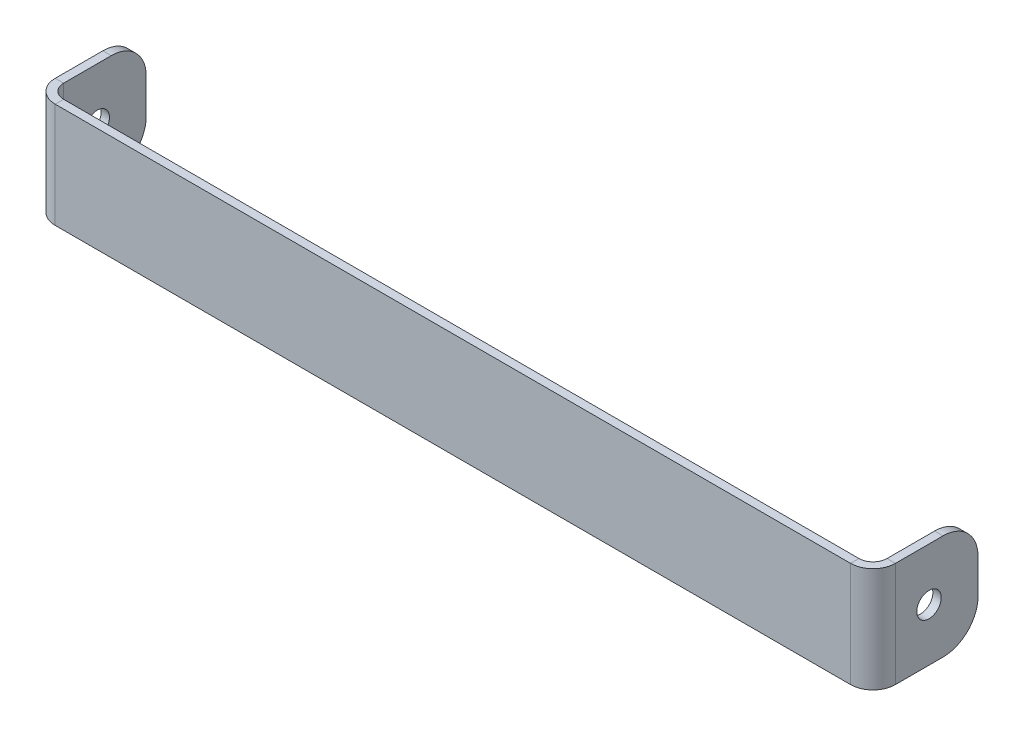
ISO-10303-21;
HEADER;
FILE_DESCRIPTION(('STEP AP214'),'2;1');
FILE_NAME('part.step','',(''),(''),'','','');
FILE_SCHEMA(('AUTOMOTIVE_DESIGN { 1 0 10303 214 1 1 1 1 }'));
ENDSEC;
DATA;
#1=APPLICATION_CONTEXT('core data for automotive mechanical design processes');
#2=APPLICATION_PROTOCOL_DEFINITION('international standard','automotive_design',2000,#1);
#3=PRODUCT_CONTEXT('',#1,'mechanical');
#4=PRODUCT('Part','Part','',(#3));
#5=PRODUCT_RELATED_PRODUCT_CATEGORY('part','',(#4));
#6=PRODUCT_DEFINITION_FORMATION('','',#4);
#7=PRODUCT_DEFINITION_CONTEXT('part definition',#1,'design');
#8=PRODUCT_DEFINITION('design','',#6,#7);
#9=PRODUCT_DEFINITION_SHAPE('','',#8);
#10=(LENGTH_UNIT() NAMED_UNIT(*) SI_UNIT(.MILLI.,.METRE.));
#11=(NAMED_UNIT(*) PLANE_ANGLE_UNIT() SI_UNIT($,.RADIAN.));
#12=(NAMED_UNIT(*) SI_UNIT($,.STERADIAN.) SOLID_ANGLE_UNIT());
#13=UNCERTAINTY_MEASURE_WITH_UNIT(LENGTH_MEASURE(1.E-05),#10,'distance_accuracy_value','');
#14=(GEOMETRIC_REPRESENTATION_CONTEXT(3) GLOBAL_UNCERTAINTY_ASSIGNED_CONTEXT((#13)) GLOBAL_UNIT_ASSIGNED_CONTEXT((#10,
#11,#12)) REPRESENTATION_CONTEXT('',''));
#15=CARTESIAN_POINT('',(0.,0.,0.));
#16=DIRECTION('',(0.,0.,1.));
#17=DIRECTION('',(1.,0.,0.));
#18=AXIS2_PLACEMENT_3D('',#15,#16,#17);
#19=CARTESIAN_POINT('',(120.,0.,3.66219024766989E-13));
#20=DIRECTION('',(-1.,0.,0.));
#21=DIRECTION('',(0.,0.,1.));
#22=AXIS2_PLACEMENT_3D('',#19,#20,#21);
#23=PLANE('',#22);
#24=DIRECTION('',(0.,1.,0.));
#25=VECTOR('',#24,1.);
#26=CARTESIAN_POINT('',(120.,0.,-15.));
#27=LINE('',#26,#25);
#28=CARTESIAN_POINT('',(120.,5.,-15.));
#29=VERTEX_POINT('',#28);
#30=CARTESIAN_POINT('',(120.,10.,-15.));
#31=VERTEX_POINT('',#30);
#32=EDGE_CURVE('E270',#29,#31,#27,.T.);
#33=ORIENTED_EDGE('',*,*,#32,.T.);
#34=CARTESIAN_POINT('',(120.,10.,-10.));
#35=DIRECTION('',(-1.,0.,0.));
#36=DIRECTION('',(0.,0.,1.));
#37=AXIS2_PLACEMENT_3D('',#34,#35,#36);
#38=CIRCLE('',#37,5.);
#39=CARTESIAN_POINT('',(120.,15.,-10.));
#40=VERTEX_POINT('',#39);
#41=EDGE_CURVE('E339',#31,#40,#38,.F.);
#42=ORIENTED_EDGE('',*,*,#41,.T.);
#43=DIRECTION('',(0.,0.,1.));
#44=VECTOR('',#43,1.);
#45=CARTESIAN_POINT('',(120.,15.,3.66219024766989E-13));
#46=LINE('',#45,#44);
#47=CARTESIAN_POINT('',(120.,15.,-3.19999999999999));
#48=VERTEX_POINT('',#47);
#49=EDGE_CURVE('E267',#40,#48,#46,.T.);
#50=ORIENTED_EDGE('',*,*,#49,.T.);
#51=DIRECTION('',(0.,-1.,0.));
#52=VECTOR('',#51,1.);
#53=CARTESIAN_POINT('',(120.,15.,-3.19999999999999));
#54=LINE('',#53,#52);
#55=CARTESIAN_POINT('',(120.,0.,-3.19999999999999));
#56=VERTEX_POINT('',#55);
#57=EDGE_CURVE('E284',#56,#48,#54,.F.);
#58=ORIENTED_EDGE('',*,*,#57,.F.);
#59=DIRECTION('',(0.,0.,-1.));
#60=VECTOR('',#59,1.);
#61=CARTESIAN_POINT('',(120.,0.,3.66219024766989E-13));
#62=LINE('',#61,#60);
#63=CARTESIAN_POINT('',(120.,0.,-10.));
#64=VERTEX_POINT('',#63);
#65=EDGE_CURVE('E273',#56,#64,#62,.T.);
#66=ORIENTED_EDGE('',*,*,#65,.T.);
#67=CARTESIAN_POINT('',(120.,5.,-10.));
#68=DIRECTION('',(-1.,0.,0.));
#69=DIRECTION('',(0.,0.,1.));
#70=AXIS2_PLACEMENT_3D('',#67,#68,#69);
#71=CIRCLE('',#70,5.);
#72=EDGE_CURVE('E337',#64,#29,#71,.F.);
#73=ORIENTED_EDGE('',*,*,#72,.T.);
#74=EDGE_LOOP('',(#33,#42,#50,#58,#66,#73));
#75=FACE_BOUND('',#74,.T.);
#76=CARTESIAN_POINT('',(120.,7.5,-8.));
#77=DIRECTION('',(1.,0.,0.));
#78=DIRECTION('',(0.,0.,-1.));
#79=AXIS2_PLACEMENT_3D('',#76,#77,#78);
#80=CIRCLE('',#79,1.75);
#81=CARTESIAN_POINT('',(120.,7.5,-9.75));
#82=VERTEX_POINT('',#81);
#83=EDGE_CURVE('E719',#82,#82,#80,.T.);
#84=ORIENTED_EDGE('',*,*,#83,.F.);
#85=EDGE_LOOP('',(#84));
#86=FACE_BOUND('',#85,.T.);
#87=ADVANCED_FACE('F90',(#75,#86),#23,.F.);
#88=CARTESIAN_POINT('',(0.,0.,-1.2));
#89=DIRECTION('',(0.,0.,-1.));
#90=DIRECTION('',(-1.,0.,0.));
#91=AXIS2_PLACEMENT_3D('',#88,#89,#90);
#92=PLANE('',#91);
#93=DIRECTION('',(1.,0.,0.));
#94=VECTOR('',#93,1.);
#95=CARTESIAN_POINT('',(0.,0.,-1.2));
#96=LINE('',#95,#94);
#97=CARTESIAN_POINT('',(3.19999999999999,0.,-1.2));
#98=VERTEX_POINT('',#97);
#99=CARTESIAN_POINT('',(116.8,0.,-1.2));
#100=VERTEX_POINT('',#99);
#101=EDGE_CURVE('E316',#98,#100,#96,.T.);
#102=ORIENTED_EDGE('',*,*,#101,.F.);
#103=DIRECTION('',(0.,1.,0.));
#104=VECTOR('',#103,1.);
#105=CARTESIAN_POINT('',(3.19999999999999,15.,-1.2));
#106=LINE('',#105,#104);
#107=CARTESIAN_POINT('',(3.19999999999999,15.,-1.2));
#108=VERTEX_POINT('',#107);
#109=EDGE_CURVE('E257',#108,#98,#106,.F.);
#110=ORIENTED_EDGE('',*,*,#109,.F.);
#111=DIRECTION('',(-1.,0.,0.));
#112=VECTOR('',#111,1.);
#113=CARTESIAN_POINT('',(0.,15.,-1.2));
#114=LINE('',#113,#112);
#115=CARTESIAN_POINT('',(116.8,15.,-1.2));
#116=VERTEX_POINT('',#115);
#117=EDGE_CURVE('E318',#116,#108,#114,.T.);
#118=ORIENTED_EDGE('',*,*,#117,.F.);
#119=DIRECTION('',(0.,-1.,0.));
#120=VECTOR('',#119,1.);
#121=CARTESIAN_POINT('',(116.8,0.,-1.2));
#122=LINE('',#121,#120);
#123=EDGE_CURVE('E306',#100,#116,#122,.F.);
#124=ORIENTED_EDGE('',*,*,#123,.F.);
#125=EDGE_LOOP('',(#102,#110,#118,#124));
#126=FACE_BOUND('',#125,.T.);
#127=ADVANCED_FACE('F381',(#126),#92,.T.);
#128=CARTESIAN_POINT('',(0.,0.,0.));
#129=DIRECTION('',(0.,0.,-1.));
#130=DIRECTION('',(-1.,0.,0.));
#131=AXIS2_PLACEMENT_3D('',#128,#129,#130);
#132=PLANE('',#131);
#133=DIRECTION('',(0.,1.,0.));
#134=VECTOR('',#133,1.);
#135=CARTESIAN_POINT('',(3.19999999999999,15.,0.));
#136=LINE('',#135,#134);
#137=CARTESIAN_POINT('',(3.19999999999999,15.,0.));
#138=VERTEX_POINT('',#137);
#139=CARTESIAN_POINT('',(3.19999999999999,0.,0.));
#140=VERTEX_POINT('',#139);
#141=EDGE_CURVE('E213',#138,#140,#136,.F.);
#142=ORIENTED_EDGE('',*,*,#141,.T.);
#143=DIRECTION('',(1.,0.,0.));
#144=VECTOR('',#143,1.);
#145=CARTESIAN_POINT('',(0.,0.,0.));
#146=LINE('',#145,#144);
#147=CARTESIAN_POINT('',(116.8,0.,0.));
#148=VERTEX_POINT('',#147);
#149=EDGE_CURVE('E314',#140,#148,#146,.T.);
#150=ORIENTED_EDGE('',*,*,#149,.T.);
#151=DIRECTION('',(0.,-1.,0.));
#152=VECTOR('',#151,1.);
#153=CARTESIAN_POINT('',(116.8,0.,0.));
#154=LINE('',#153,#152);
#155=CARTESIAN_POINT('',(116.8,15.,0.));
#156=VERTEX_POINT('',#155);
#157=EDGE_CURVE('E294',#148,#156,#154,.F.);
#158=ORIENTED_EDGE('',*,*,#157,.T.);
#159=DIRECTION('',(-1.,0.,0.));
#160=VECTOR('',#159,1.);
#161=CARTESIAN_POINT('',(0.,15.,0.));
#162=LINE('',#161,#160);
#163=EDGE_CURVE('E319',#156,#138,#162,.T.);
#164=ORIENTED_EDGE('',*,*,#163,.T.);
#165=EDGE_LOOP('',(#142,#150,#158,#164));
#166=FACE_BOUND('',#165,.T.);
#167=ADVANCED_FACE('F428',(#166),#132,.F.);
#168=CARTESIAN_POINT('',(0.,15.,-1.2));
#169=DIRECTION('',(0.,1.,0.));
#170=DIRECTION('',(0.,0.,1.));
#171=AXIS2_PLACEMENT_3D('',#168,#169,#170);
#172=PLANE('',#171);
#173=ORIENTED_EDGE('',*,*,#117,.T.);
#174=DIRECTION('',(0.,0.,1.));
#175=VECTOR('',#174,1.);
#176=CARTESIAN_POINT('',(3.19999999999999,15.,-1.2));
#177=LINE('',#176,#175);
#178=EDGE_CURVE('E253',#108,#138,#177,.T.);
#179=ORIENTED_EDGE('',*,*,#178,.T.);
#180=ORIENTED_EDGE('',*,*,#163,.F.);
#181=DIRECTION('',(0.,0.,1.));
#182=VECTOR('',#181,1.);
#183=CARTESIAN_POINT('',(116.8,15.,-1.2));
#184=LINE('',#183,#182);
#185=EDGE_CURVE('E311',#116,#156,#184,.T.);
#186=ORIENTED_EDGE('',*,*,#185,.F.);
#187=EDGE_LOOP('',(#173,#179,#180,#186));
#188=FACE_BOUND('',#187,.T.);
#189=ADVANCED_FACE('F430',(#188),#172,.T.);
#190=CARTESIAN_POINT('',(0.,0.,-1.2));
#191=DIRECTION('',(0.,-1.,0.));
#192=DIRECTION('',(0.,0.,-1.));
#193=AXIS2_PLACEMENT_3D('',#190,#191,#192);
#194=PLANE('',#193);
#195=DIRECTION('',(0.,0.,1.));
#196=VECTOR('',#195,1.);
#197=CARTESIAN_POINT('',(3.19999999999999,0.,-1.2));
#198=LINE('',#197,#196);
#199=EDGE_CURVE('E261',#98,#140,#198,.T.);
#200=ORIENTED_EDGE('',*,*,#199,.F.);
#201=ORIENTED_EDGE('',*,*,#101,.T.);
#202=DIRECTION('',(0.,0.,1.));
#203=VECTOR('',#202,1.);
#204=CARTESIAN_POINT('',(116.8,0.,-1.2));
#205=LINE('',#204,#203);
#206=EDGE_CURVE('E300',#100,#148,#205,.T.);
#207=ORIENTED_EDGE('',*,*,#206,.T.);
#208=ORIENTED_EDGE('',*,*,#149,.F.);
#209=EDGE_LOOP('',(#200,#201,#207,#208));
#210=FACE_BOUND('',#209,.T.);
#211=ADVANCED_FACE('F378',(#210),#194,.T.);
#212=CARTESIAN_POINT('',(116.8,15.,-3.2));
#213=DIRECTION('',(0.,1.,0.));
#214=DIRECTION('',(0.,0.,1.));
#215=AXIS2_PLACEMENT_3D('',#212,#213,#214);
#216=PLANE('',#215);
#217=DIRECTION('',(-1.,0.,0.));
#218=VECTOR('',#217,1.);
#219=CARTESIAN_POINT('',(120.,15.,-3.19999999999999));
#220=LINE('',#219,#218);
#221=CARTESIAN_POINT('',(118.8,15.,-3.19999999999999));
#222=VERTEX_POINT('',#221);
#223=EDGE_CURVE('E264',#222,#48,#220,.F.);
#224=ORIENTED_EDGE('',*,*,#223,.F.);
#225=CARTESIAN_POINT('',(116.8,15.,-3.2));
#226=DIRECTION('',(0.,-1.,0.));
#227=DIRECTION('',(0.,0.,-1.));
#228=AXIS2_PLACEMENT_3D('',#225,#226,#227);
#229=CIRCLE('',#228,2.);
#230=EDGE_CURVE('E303',#116,#222,#229,.F.);
#231=ORIENTED_EDGE('',*,*,#230,.F.);
#232=ORIENTED_EDGE('',*,*,#185,.T.);
#233=CARTESIAN_POINT('',(116.8,15.,-3.2));
#234=DIRECTION('',(0.,-1.,0.));
#235=DIRECTION('',(0.,0.,-1.));
#236=AXIS2_PLACEMENT_3D('',#233,#234,#235);
#237=CIRCLE('',#236,3.2);
#238=EDGE_CURVE('E296',#156,#48,#237,.F.);
#239=ORIENTED_EDGE('',*,*,#238,.T.);
#240=EDGE_LOOP('',(#224,#231,#232,#239));
#241=FACE_BOUND('',#240,.T.);
#242=ADVANCED_FACE('F421',(#241),#216,.T.);
#243=CARTESIAN_POINT('',(116.8,0.,-3.2));
#244=DIRECTION('',(0.,1.,0.));
#245=DIRECTION('',(0.,0.,1.));
#246=AXIS2_PLACEMENT_3D('',#243,#244,#245);
#247=PLANE('',#246);
#248=CARTESIAN_POINT('',(116.8,0.,-3.2));
#249=DIRECTION('',(0.,-1.,0.));
#250=DIRECTION('',(0.,0.,-1.));
#251=AXIS2_PLACEMENT_3D('',#248,#249,#250);
#252=CIRCLE('',#251,2.);
#253=CARTESIAN_POINT('',(118.8,0.,-3.19999999999999));
#254=VERTEX_POINT('',#253);
#255=EDGE_CURVE('E269',#254,#100,#252,.T.);
#256=ORIENTED_EDGE('',*,*,#255,.F.);
#257=DIRECTION('',(-1.,0.,0.));
#258=VECTOR('',#257,1.);
#259=CARTESIAN_POINT('',(118.8,0.,-3.19999999999999));
#260=LINE('',#259,#258);
#261=EDGE_CURVE('E287',#254,#56,#260,.F.);
#262=ORIENTED_EDGE('',*,*,#261,.T.);
#263=CARTESIAN_POINT('',(116.8,0.,-3.2));
#264=DIRECTION('',(0.,-1.,0.));
#265=DIRECTION('',(0.,0.,-1.));
#266=AXIS2_PLACEMENT_3D('',#263,#264,#265);
#267=CIRCLE('',#266,3.2);
#268=EDGE_CURVE('E297',#56,#148,#267,.T.);
#269=ORIENTED_EDGE('',*,*,#268,.T.);
#270=ORIENTED_EDGE('',*,*,#206,.F.);
#271=EDGE_LOOP('',(#256,#262,#269,#270));
#272=FACE_BOUND('',#271,.T.);
#273=ADVANCED_FACE('F388',(#272),#247,.F.);
#274=CARTESIAN_POINT('',(116.8,0.,-3.2));
#275=DIRECTION('',(0.,-1.,0.));
#276=DIRECTION('',(1.,0.,0.));
#277=AXIS2_PLACEMENT_3D('',#274,#275,#276);
#278=CYLINDRICAL_SURFACE('',#277,3.2);
#279=ORIENTED_EDGE('',*,*,#157,.F.);
#280=ORIENTED_EDGE('',*,*,#268,.F.);
#281=ORIENTED_EDGE('',*,*,#57,.T.);
#282=ORIENTED_EDGE('',*,*,#238,.F.);
#283=EDGE_LOOP('',(#279,#280,#281,#282));
#284=FACE_BOUND('',#283,.T.);
#285=ADVANCED_FACE('F425',(#284),#278,.T.);
#286=CARTESIAN_POINT('',(116.8,0.,-3.2));
#287=DIRECTION('',(0.,-1.,0.));
#288=DIRECTION('',(1.,0.,0.));
#289=AXIS2_PLACEMENT_3D('',#286,#287,#288);
#290=CYLINDRICAL_SURFACE('',#289,2.);
#291=ORIENTED_EDGE('',*,*,#123,.T.);
#292=ORIENTED_EDGE('',*,*,#230,.T.);
#293=DIRECTION('',(0.,-1.,0.));
#294=VECTOR('',#293,1.);
#295=CARTESIAN_POINT('',(118.8,15.,-3.19999999999999));
#296=LINE('',#295,#294);
#297=EDGE_CURVE('E290',#222,#254,#296,.T.);
#298=ORIENTED_EDGE('',*,*,#297,.T.);
#299=ORIENTED_EDGE('',*,*,#255,.T.);
#300=EDGE_LOOP('',(#291,#292,#298,#299));
#301=FACE_BOUND('',#300,.T.);
#302=ADVANCED_FACE('F390',(#301),#290,.F.);
#303=CARTESIAN_POINT('',(120.,0.,-15.));
#304=DIRECTION('',(0.,1.,0.));
#305=DIRECTION('',(0.,0.,1.));
#306=AXIS2_PLACEMENT_3D('',#303,#304,#305);
#307=PLANE('',#306);
#308=DIRECTION('',(0.,0.,1.));
#309=VECTOR('',#308,1.);
#310=CARTESIAN_POINT('',(118.8,0.,-15.));
#311=LINE('',#310,#309);
#312=CARTESIAN_POINT('',(118.8,0.,-10.));
#313=VERTEX_POINT('',#312);
#314=EDGE_CURVE('E281',#254,#313,#311,.F.);
#315=ORIENTED_EDGE('',*,*,#314,.T.);
#316=DIRECTION('',(-1.,0.,0.));
#317=VECTOR('',#316,1.);
#318=CARTESIAN_POINT('',(120.,0.,-10.));
#319=LINE('',#318,#317);
#320=EDGE_CURVE('E341',#313,#64,#319,.F.);
#321=ORIENTED_EDGE('',*,*,#320,.T.);
#322=ORIENTED_EDGE('',*,*,#65,.F.);
#323=ORIENTED_EDGE('',*,*,#261,.F.);
#324=EDGE_LOOP('',(#315,#321,#322,#323));
#325=FACE_BOUND('',#324,.T.);
#326=ADVANCED_FACE('F399',(#325),#307,.F.);
#327=CARTESIAN_POINT('',(120.,15.,-1.2));
#328=DIRECTION('',(0.,-1.,0.));
#329=DIRECTION('',(0.,0.,-1.));
#330=AXIS2_PLACEMENT_3D('',#327,#328,#329);
#331=PLANE('',#330);
#332=ORIENTED_EDGE('',*,*,#49,.F.);
#333=DIRECTION('',(-1.,0.,0.));
#334=VECTOR('',#333,1.);
#335=CARTESIAN_POINT('',(120.,15.,-10.));
#336=LINE('',#335,#334);
#337=CARTESIAN_POINT('',(118.8,15.,-10.));
#338=VERTEX_POINT('',#337);
#339=EDGE_CURVE('E322',#40,#338,#336,.T.);
#340=ORIENTED_EDGE('',*,*,#339,.T.);
#341=DIRECTION('',(0.,0.,-1.));
#342=VECTOR('',#341,1.);
#343=CARTESIAN_POINT('',(118.8,15.,-1.2));
#344=LINE('',#343,#342);
#345=EDGE_CURVE('E276',#338,#222,#344,.F.);
#346=ORIENTED_EDGE('',*,*,#345,.T.);
#347=ORIENTED_EDGE('',*,*,#223,.T.);
#348=EDGE_LOOP('',(#332,#340,#346,#347));
#349=FACE_BOUND('',#348,.T.);
#350=ADVANCED_FACE('F418',(#349),#331,.F.);
#351=CARTESIAN_POINT('',(118.8,0.,3.62029247160377E-13));
#352=DIRECTION('',(-1.,0.,0.));
#353=DIRECTION('',(0.,0.,1.));
#354=AXIS2_PLACEMENT_3D('',#351,#352,#353);
#355=PLANE('',#354);
#356=CARTESIAN_POINT('',(118.8,7.5,-8.));
#357=DIRECTION('',(-1.,0.,0.));
#358=DIRECTION('',(0.,0.,1.));
#359=AXIS2_PLACEMENT_3D('',#356,#357,#358);
#360=CIRCLE('',#359,1.75);
#361=CARTESIAN_POINT('',(118.8,7.5,-6.25));
#362=VERTEX_POINT('',#361);
#363=EDGE_CURVE('E250',#362,#362,#360,.T.);
#364=ORIENTED_EDGE('',*,*,#363,.F.);
#365=EDGE_LOOP('',(#364));
#366=FACE_BOUND('',#365,.T.);
#367=ORIENTED_EDGE('',*,*,#345,.F.);
#368=CARTESIAN_POINT('',(118.8,10.,-10.));
#369=DIRECTION('',(-1.,0.,0.));
#370=DIRECTION('',(0.,0.,1.));
#371=AXIS2_PLACEMENT_3D('',#368,#369,#370);
#372=CIRCLE('',#371,5.);
#373=CARTESIAN_POINT('',(118.8,10.,-15.));
#374=VERTEX_POINT('',#373);
#375=EDGE_CURVE('E330',#338,#374,#372,.T.);
#376=ORIENTED_EDGE('',*,*,#375,.T.);
#377=DIRECTION('',(0.,-1.,0.));
#378=VECTOR('',#377,1.);
#379=CARTESIAN_POINT('',(118.8,15.,-15.));
#380=LINE('',#379,#378);
#381=CARTESIAN_POINT('',(118.8,5.,-15.));
#382=VERTEX_POINT('',#381);
#383=EDGE_CURVE('E278',#382,#374,#380,.F.);
#384=ORIENTED_EDGE('',*,*,#383,.F.);
#385=CARTESIAN_POINT('',(118.8,5.,-10.));
#386=DIRECTION('',(-1.,0.,0.));
#387=DIRECTION('',(0.,0.,1.));
#388=AXIS2_PLACEMENT_3D('',#385,#386,#387);
#389=CIRCLE('',#388,5.);
#390=EDGE_CURVE('E328',#382,#313,#389,.T.);
#391=ORIENTED_EDGE('',*,*,#390,.T.);
#392=ORIENTED_EDGE('',*,*,#314,.F.);
#393=ORIENTED_EDGE('',*,*,#297,.F.);
#394=EDGE_LOOP('',(#367,#376,#384,#391,#392,#393));
#395=FACE_BOUND('',#394,.T.);
#396=ADVANCED_FACE('F395',(#366,#395),#355,.T.);
#397=CARTESIAN_POINT('',(120.,15.,-15.));
#398=DIRECTION('',(0.,0.,1.));
#399=DIRECTION('',(1.,0.,0.));
#400=AXIS2_PLACEMENT_3D('',#397,#398,#399);
#401=PLANE('',#400);
#402=ORIENTED_EDGE('',*,*,#383,.T.);
#403=DIRECTION('',(-1.,0.,0.));
#404=VECTOR('',#403,1.);
#405=CARTESIAN_POINT('',(120.,10.,-15.));
#406=LINE('',#405,#404);
#407=EDGE_CURVE('E335',#374,#31,#406,.F.);
#408=ORIENTED_EDGE('',*,*,#407,.T.);
#409=ORIENTED_EDGE('',*,*,#32,.F.);
#410=DIRECTION('',(-1.,0.,0.));
#411=VECTOR('',#410,1.);
#412=CARTESIAN_POINT('',(120.,5.,-15.));
#413=LINE('',#412,#411);
#414=EDGE_CURVE('E332',#29,#382,#413,.T.);
#415=ORIENTED_EDGE('',*,*,#414,.T.);
#416=EDGE_LOOP('',(#402,#408,#409,#415));
#417=FACE_BOUND('',#416,.T.);
#418=ADVANCED_FACE('F411',(#417),#401,.F.);
#419=CARTESIAN_POINT('',(3.19999999999999,0.,-3.2));
#420=DIRECTION('',(0.,-1.,0.));
#421=DIRECTION('',(0.,0.,-1.));
#422=AXIS2_PLACEMENT_3D('',#419,#420,#421);
#423=PLANE('',#422);
#424=DIRECTION('',(1.,0.,0.));
#425=VECTOR('',#424,1.);
#426=CARTESIAN_POINT('',(0.,0.,-3.19999999999999));
#427=LINE('',#426,#425);
#428=CARTESIAN_POINT('',(1.19999999999999,0.,-3.19999999999999));
#429=VERTEX_POINT('',#428);
#430=CARTESIAN_POINT('',(0.,0.,-3.19999999999999));
#431=VERTEX_POINT('',#430);
#432=EDGE_CURVE('E247',#429,#431,#427,.F.);
#433=ORIENTED_EDGE('',*,*,#432,.F.);
#434=CARTESIAN_POINT('',(3.19999999999999,0.,-3.2));
#435=DIRECTION('',(0.,1.,0.));
#436=DIRECTION('',(0.,0.,1.));
#437=AXIS2_PLACEMENT_3D('',#434,#435,#436);
#438=CIRCLE('',#437,2.);
#439=EDGE_CURVE('E216',#98,#429,#438,.F.);
#440=ORIENTED_EDGE('',*,*,#439,.F.);
#441=ORIENTED_EDGE('',*,*,#199,.T.);
#442=CARTESIAN_POINT('',(3.19999999999999,0.,-3.2));
#443=DIRECTION('',(0.,1.,0.));
#444=DIRECTION('',(0.,0.,1.));
#445=AXIS2_PLACEMENT_3D('',#442,#443,#444);
#446=CIRCLE('',#445,3.2);
#447=EDGE_CURVE('E252',#140,#431,#446,.F.);
#448=ORIENTED_EDGE('',*,*,#447,.T.);
#449=EDGE_LOOP('',(#433,#440,#441,#448));
#450=FACE_BOUND('',#449,.T.);
#451=ADVANCED_FACE('F374',(#450),#423,.T.);
#452=CARTESIAN_POINT('',(3.19999999999999,15.,-3.2));
#453=DIRECTION('',(0.,-1.,0.));
#454=DIRECTION('',(0.,0.,-1.));
#455=AXIS2_PLACEMENT_3D('',#452,#453,#454);
#456=PLANE('',#455);
#457=CARTESIAN_POINT('',(3.19999999999999,15.,-3.2));
#458=DIRECTION('',(0.,1.,0.));
#459=DIRECTION('',(0.,0.,1.));
#460=AXIS2_PLACEMENT_3D('',#457,#458,#459);
#461=CIRCLE('',#460,2.);
#462=CARTESIAN_POINT('',(1.19999999999999,15.,-3.19999999999999));
#463=VERTEX_POINT('',#462);
#464=EDGE_CURVE('E223',#463,#108,#461,.T.);
#465=ORIENTED_EDGE('',*,*,#464,.F.);
#466=DIRECTION('',(1.,0.,0.));
#467=VECTOR('',#466,1.);
#468=CARTESIAN_POINT('',(1.19999999999999,15.,-3.19999999999999));
#469=LINE('',#468,#467);
#470=CARTESIAN_POINT('',(0.,15.,-3.19999999999999));
#471=VERTEX_POINT('',#470);
#472=EDGE_CURVE('E220',#463,#471,#469,.F.);
#473=ORIENTED_EDGE('',*,*,#472,.T.);
#474=CARTESIAN_POINT('',(3.19999999999999,15.,-3.2));
#475=DIRECTION('',(0.,1.,0.));
#476=DIRECTION('',(0.,0.,1.));
#477=AXIS2_PLACEMENT_3D('',#474,#475,#476);
#478=CIRCLE('',#477,3.2);
#479=EDGE_CURVE('E206',#471,#138,#478,.T.);
#480=ORIENTED_EDGE('',*,*,#479,.T.);
#481=ORIENTED_EDGE('',*,*,#178,.F.);
#482=EDGE_LOOP('',(#465,#473,#480,#481));
#483=FACE_BOUND('',#482,.T.);
#484=ADVANCED_FACE('F221',(#483),#456,.F.);
#485=CARTESIAN_POINT('',(3.19999999999999,15.,-3.2));
#486=DIRECTION('',(0.,1.,0.));
#487=DIRECTION('',(-1.,0.,0.));
#488=AXIS2_PLACEMENT_3D('',#485,#486,#487);
#489=CYLINDRICAL_SURFACE('',#488,3.2);
#490=ORIENTED_EDGE('',*,*,#141,.F.);
#491=ORIENTED_EDGE('',*,*,#479,.F.);
#492=DIRECTION('',(0.,1.,0.));
#493=VECTOR('',#492,1.);
#494=CARTESIAN_POINT('',(0.,0.,-3.19999999999999));
#495=LINE('',#494,#493);
#496=EDGE_CURVE('E211',#471,#431,#495,.F.);
#497=ORIENTED_EDGE('',*,*,#496,.T.);
#498=ORIENTED_EDGE('',*,*,#447,.F.);
#499=EDGE_LOOP('',(#490,#491,#497,#498));
#500=FACE_BOUND('',#499,.T.);
#501=ADVANCED_FACE('F208',(#500),#489,.T.);
#502=CARTESIAN_POINT('',(3.19999999999999,15.,-3.2));
#503=DIRECTION('',(0.,1.,0.));
#504=DIRECTION('',(-1.,0.,0.));
#505=AXIS2_PLACEMENT_3D('',#502,#503,#504);
#506=CYLINDRICAL_SURFACE('',#505,2.);
#507=ORIENTED_EDGE('',*,*,#109,.T.);
#508=ORIENTED_EDGE('',*,*,#439,.T.);
#509=DIRECTION('',(0.,1.,0.));
#510=VECTOR('',#509,1.);
#511=CARTESIAN_POINT('',(1.19999999999999,0.,-3.19999999999999));
#512=LINE('',#511,#510);
#513=EDGE_CURVE('E225',#429,#463,#512,.T.);
#514=ORIENTED_EDGE('',*,*,#513,.T.);
#515=ORIENTED_EDGE('',*,*,#464,.T.);
#516=EDGE_LOOP('',(#507,#508,#514,#515));
#517=FACE_BOUND('',#516,.T.);
#518=ADVANCED_FACE('F371',(#517),#506,.F.);
#519=CARTESIAN_POINT('',(0.,15.,-15.));
#520=DIRECTION('',(0.,-1.,0.));
#521=DIRECTION('',(0.,0.,-1.));
#522=AXIS2_PLACEMENT_3D('',#519,#520,#521);
#523=PLANE('',#522);
#524=DIRECTION('',(0.,0.,1.));
#525=VECTOR('',#524,1.);
#526=CARTESIAN_POINT('',(1.19999999999995,15.,-15.));
#527=LINE('',#526,#525);
#528=CARTESIAN_POINT('',(1.19999999999997,15.,-10.));
#529=VERTEX_POINT('',#528);
#530=EDGE_CURVE('E233',#463,#529,#527,.F.);
#531=ORIENTED_EDGE('',*,*,#530,.T.);
#532=DIRECTION('',(1.,0.,0.));
#533=VECTOR('',#532,1.);
#534=CARTESIAN_POINT('',(0.,15.,-10.));
#535=LINE('',#534,#533);
#536=CARTESIAN_POINT('',(0.,15.,-10.));
#537=VERTEX_POINT('',#536);
#538=EDGE_CURVE('E15',#529,#537,#535,.F.);
#539=ORIENTED_EDGE('',*,*,#538,.T.);
#540=DIRECTION('',(0.,0.,-1.));
#541=VECTOR('',#540,1.);
#542=CARTESIAN_POINT('',(0.,15.,0.));
#543=LINE('',#542,#541);
#544=EDGE_CURVE('E229',#471,#537,#543,.T.);
#545=ORIENTED_EDGE('',*,*,#544,.F.);
#546=ORIENTED_EDGE('',*,*,#472,.F.);
#547=EDGE_LOOP('',(#531,#539,#545,#546));
#548=FACE_BOUND('',#547,.T.);
#549=ADVANCED_FACE('F235',(#548),#523,.F.);
#550=CARTESIAN_POINT('',(0.,0.,-1.2));
#551=DIRECTION('',(0.,1.,0.));
#552=DIRECTION('',(0.,0.,1.));
#553=AXIS2_PLACEMENT_3D('',#550,#551,#552);
#554=PLANE('',#553);
#555=DIRECTION('',(0.,0.,1.));
#556=VECTOR('',#555,1.);
#557=CARTESIAN_POINT('',(0.,0.,0.));
#558=LINE('',#557,#556);
#559=CARTESIAN_POINT('',(0.,0.,-10.));
#560=VERTEX_POINT('',#559);
#561=EDGE_CURVE('E232',#560,#431,#558,.T.);
#562=ORIENTED_EDGE('',*,*,#561,.F.);
#563=DIRECTION('',(1.,0.,0.));
#564=VECTOR('',#563,1.);
#565=CARTESIAN_POINT('',(0.,0.,-10.));
#566=LINE('',#565,#564);
#567=CARTESIAN_POINT('',(1.19999999999997,0.,-10.));
#568=VERTEX_POINT('',#567);
#569=EDGE_CURVE('E343',#560,#568,#566,.T.);
#570=ORIENTED_EDGE('',*,*,#569,.T.);
#571=DIRECTION('',(0.,0.,-1.));
#572=VECTOR('',#571,1.);
#573=CARTESIAN_POINT('',(1.2,0.,-1.2));
#574=LINE('',#573,#572);
#575=EDGE_CURVE('E237',#568,#429,#574,.F.);
#576=ORIENTED_EDGE('',*,*,#575,.T.);
#577=ORIENTED_EDGE('',*,*,#432,.T.);
#578=EDGE_LOOP('',(#562,#570,#576,#577));
#579=FACE_BOUND('',#578,.T.);
#580=ADVANCED_FACE('F359',(#579),#554,.F.);
#581=CARTESIAN_POINT('',(0.,0.,0.));
#582=DIRECTION('',(1.,0.,0.));
#583=DIRECTION('',(0.,0.,-1.));
#584=AXIS2_PLACEMENT_3D('',#581,#582,#583);
#585=PLANE('',#584);
#586=CARTESIAN_POINT('',(0.,7.5,-7.99999999999959));
#587=DIRECTION('',(-1.,0.,0.));
#588=DIRECTION('',(0.,0.,1.));
#589=AXIS2_PLACEMENT_3D('',#586,#587,#588);
#590=CIRCLE('',#589,1.74999999999999);
#591=CARTESIAN_POINT('',(0.,7.5,-6.2499999999996));
#592=VERTEX_POINT('',#591);
#593=EDGE_CURVE('E715',#592,#592,#590,.T.);
#594=ORIENTED_EDGE('',*,*,#593,.F.);
#595=EDGE_LOOP('',(#594));
#596=FACE_BOUND('',#595,.T.);
#597=DIRECTION('',(0.,-1.,0.));
#598=VECTOR('',#597,1.);
#599=CARTESIAN_POINT('',(0.,0.,-15.));
#600=LINE('',#599,#598);
#601=CARTESIAN_POINT('',(0.,10.,-15.));
#602=VERTEX_POINT('',#601);
#603=CARTESIAN_POINT('',(0.,5.,-15.));
#604=VERTEX_POINT('',#603);
#605=EDGE_CURVE('E236',#602,#604,#600,.T.);
#606=ORIENTED_EDGE('',*,*,#605,.T.);
#607=CARTESIAN_POINT('',(0.,5.,-10.));
#608=DIRECTION('',(1.,0.,0.));
#609=DIRECTION('',(0.,0.,-1.));
#610=AXIS2_PLACEMENT_3D('',#607,#608,#609);
#611=CIRCLE('',#610,5.);
#612=EDGE_CURVE('E98',#604,#560,#611,.F.);
#613=ORIENTED_EDGE('',*,*,#612,.T.);
#614=ORIENTED_EDGE('',*,*,#561,.T.);
#615=ORIENTED_EDGE('',*,*,#496,.F.);
#616=ORIENTED_EDGE('',*,*,#544,.T.);
#617=CARTESIAN_POINT('',(0.,10.,-10.));
#618=DIRECTION('',(1.,0.,0.));
#619=DIRECTION('',(0.,0.,-1.));
#620=AXIS2_PLACEMENT_3D('',#617,#618,#619);
#621=CIRCLE('',#620,5.);
#622=EDGE_CURVE('E354',#537,#602,#621,.F.);
#623=ORIENTED_EDGE('',*,*,#622,.T.);
#624=EDGE_LOOP('',(#606,#613,#614,#615,#616,#623));
#625=FACE_BOUND('',#624,.T.);
#626=ADVANCED_FACE('F228',(#596,#625),#585,.F.);
#627=CARTESIAN_POINT('',(1.2,0.,0.));
#628=DIRECTION('',(1.,0.,0.));
#629=DIRECTION('',(0.,0.,-1.));
#630=AXIS2_PLACEMENT_3D('',#627,#628,#629);
#631=PLANE('',#630);
#632=CARTESIAN_POINT('',(1.19999999999998,7.5,-7.99999999999959));
#633=DIRECTION('',(1.,0.,0.));
#634=DIRECTION('',(0.,0.,-1.));
#635=AXIS2_PLACEMENT_3D('',#632,#633,#634);
#636=CIRCLE('',#635,1.74999999999999);
#637=CARTESIAN_POINT('',(1.19999999999997,7.5,-9.74999999999959));
#638=VERTEX_POINT('',#637);
#639=EDGE_CURVE('E718',#638,#638,#636,.T.);
#640=ORIENTED_EDGE('',*,*,#639,.F.);
#641=EDGE_LOOP('',(#640));
#642=FACE_BOUND('',#641,.T.);
#643=ORIENTED_EDGE('',*,*,#575,.F.);
#644=CARTESIAN_POINT('',(1.19999999999997,5.,-10.));
#645=DIRECTION('',(1.,0.,0.));
#646=DIRECTION('',(0.,0.,-1.));
#647=AXIS2_PLACEMENT_3D('',#644,#645,#646);
#648=CIRCLE('',#647,5.);
#649=CARTESIAN_POINT('',(1.19999999999995,5.,-15.));
#650=VERTEX_POINT('',#649);
#651=EDGE_CURVE('E348',#568,#650,#648,.T.);
#652=ORIENTED_EDGE('',*,*,#651,.T.);
#653=DIRECTION('',(0.,1.,0.));
#654=VECTOR('',#653,1.);
#655=CARTESIAN_POINT('',(1.19999999999995,0.,-15.));
#656=LINE('',#655,#654);
#657=CARTESIAN_POINT('',(1.19999999999995,10.,-15.));
#658=VERTEX_POINT('',#657);
#659=EDGE_CURVE('E240',#658,#650,#656,.F.);
#660=ORIENTED_EDGE('',*,*,#659,.F.);
#661=CARTESIAN_POINT('',(1.19999999999997,10.,-10.));
#662=DIRECTION('',(1.,0.,0.));
#663=DIRECTION('',(0.,0.,-1.));
#664=AXIS2_PLACEMENT_3D('',#661,#662,#663);
#665=CIRCLE('',#664,5.);
#666=EDGE_CURVE('E346',#658,#529,#665,.T.);
#667=ORIENTED_EDGE('',*,*,#666,.T.);
#668=ORIENTED_EDGE('',*,*,#530,.F.);
#669=ORIENTED_EDGE('',*,*,#513,.F.);
#670=EDGE_LOOP('',(#643,#652,#660,#667,#668,#669));
#671=FACE_BOUND('',#670,.T.);
#672=ADVANCED_FACE('F365',(#642,#671),#631,.T.);
#673=CARTESIAN_POINT('',(0.,0.,-15.));
#674=DIRECTION('',(0.,0.,1.));
#675=DIRECTION('',(1.,0.,0.));
#676=AXIS2_PLACEMENT_3D('',#673,#674,#675);
#677=PLANE('',#676);
#678=ORIENTED_EDGE('',*,*,#659,.T.);
#679=DIRECTION('',(1.,0.,0.));
#680=VECTOR('',#679,1.);
#681=CARTESIAN_POINT('',(0.,5.,-15.));
#682=LINE('',#681,#680);
#683=EDGE_CURVE('E111',#650,#604,#682,.F.);
#684=ORIENTED_EDGE('',*,*,#683,.T.);
#685=ORIENTED_EDGE('',*,*,#605,.F.);
#686=DIRECTION('',(1.,0.,0.));
#687=VECTOR('',#686,1.);
#688=CARTESIAN_POINT('',(0.,10.,-15.));
#689=LINE('',#688,#687);
#690=EDGE_CURVE('E350',#602,#658,#689,.T.);
#691=ORIENTED_EDGE('',*,*,#690,.T.);
#692=EDGE_LOOP('',(#678,#684,#685,#691));
#693=FACE_BOUND('',#692,.T.);
#694=ADVANCED_FACE('F367',(#693),#677,.F.);
#695=CARTESIAN_POINT('',(120.,10.,-10.));
#696=DIRECTION('',(-1.,0.,0.));
#697=DIRECTION('',(0.,0.,1.));
#698=AXIS2_PLACEMENT_3D('',#695,#696,#697);
#699=CYLINDRICAL_SURFACE('',#698,5.);
#700=ORIENTED_EDGE('',*,*,#41,.F.);
#701=ORIENTED_EDGE('',*,*,#407,.F.);
#702=ORIENTED_EDGE('',*,*,#375,.F.);
#703=ORIENTED_EDGE('',*,*,#339,.F.);
#704=EDGE_LOOP('',(#700,#701,#702,#703));
#705=FACE_BOUND('',#704,.T.);
#706=ADVANCED_FACE('F414',(#705),#699,.T.);
#707=CARTESIAN_POINT('',(120.,5.,-10.));
#708=DIRECTION('',(-1.,0.,0.));
#709=DIRECTION('',(0.,0.,1.));
#710=AXIS2_PLACEMENT_3D('',#707,#708,#709);
#711=CYLINDRICAL_SURFACE('',#710,5.);
#712=ORIENTED_EDGE('',*,*,#72,.F.);
#713=ORIENTED_EDGE('',*,*,#320,.F.);
#714=ORIENTED_EDGE('',*,*,#390,.F.);
#715=ORIENTED_EDGE('',*,*,#414,.F.);
#716=EDGE_LOOP('',(#712,#713,#714,#715));
#717=FACE_BOUND('',#716,.T.);
#718=ADVANCED_FACE('F403',(#717),#711,.T.);
#719=CARTESIAN_POINT('',(0.,5.,-10.));
#720=DIRECTION('',(1.,0.,0.));
#721=DIRECTION('',(0.,0.,-1.));
#722=AXIS2_PLACEMENT_3D('',#719,#720,#721);
#723=CYLINDRICAL_SURFACE('',#722,5.);
#724=ORIENTED_EDGE('',*,*,#612,.F.);
#725=ORIENTED_EDGE('',*,*,#683,.F.);
#726=ORIENTED_EDGE('',*,*,#651,.F.);
#727=ORIENTED_EDGE('',*,*,#569,.F.);
#728=EDGE_LOOP('',(#724,#725,#726,#727));
#729=FACE_BOUND('',#728,.T.);
#730=ADVANCED_FACE('F362',(#729),#723,.T.);
#731=CARTESIAN_POINT('',(0.,10.,-10.));
#732=DIRECTION('',(1.,0.,0.));
#733=DIRECTION('',(0.,0.,-1.));
#734=AXIS2_PLACEMENT_3D('',#731,#732,#733);
#735=CYLINDRICAL_SURFACE('',#734,5.);
#736=ORIENTED_EDGE('',*,*,#622,.F.);
#737=ORIENTED_EDGE('',*,*,#538,.F.);
#738=ORIENTED_EDGE('',*,*,#666,.F.);
#739=ORIENTED_EDGE('',*,*,#690,.F.);
#740=EDGE_LOOP('',(#736,#737,#738,#739));
#741=FACE_BOUND('',#740,.T.);
#742=ADVANCED_FACE('F92',(#741),#735,.T.);
#743=CARTESIAN_POINT('',(120.,7.5,-8.));
#744=DIRECTION('',(1.,0.,0.));
#745=DIRECTION('',(0.,0.,-1.));
#746=AXIS2_PLACEMENT_3D('',#743,#744,#745);
#747=CYLINDRICAL_SURFACE('',#746,1.75);
#748=ORIENTED_EDGE('',*,*,#83,.T.);
#749=EDGE_LOOP('',(#748));
#750=FACE_BOUND('',#749,.T.);
#751=ORIENTED_EDGE('',*,*,#363,.T.);
#752=EDGE_LOOP('',(#751));
#753=FACE_BOUND('',#752,.T.);
#754=ADVANCED_FACE('F571',(#750,#753),#747,.F.);
#755=CARTESIAN_POINT('',(0.,7.5,-7.99999999999959));
#756=DIRECTION('',(-1.,0.,0.));
#757=DIRECTION('',(0.,0.,1.));
#758=AXIS2_PLACEMENT_3D('',#755,#756,#757);
#759=CYLINDRICAL_SURFACE('',#758,1.74999999999999);
#760=ORIENTED_EDGE('',*,*,#593,.T.);
#761=EDGE_LOOP('',(#760));
#762=FACE_BOUND('',#761,.T.);
#763=ORIENTED_EDGE('',*,*,#639,.T.);
#764=EDGE_LOOP('',(#763));
#765=FACE_BOUND('',#764,.T.);
#766=ADVANCED_FACE('F576',(#762,#765),#759,.F.);
#767=CLOSED_SHELL('',(#87,#127,#167,#189,#211,#242,#273,#285,#302,#326,#350,#396,#418,#451,#484,
#501,#518,#549,#580,#626,#672,#694,#706,#718,#730,#742,#754,#766));
#768=MANIFOLD_SOLID_BREP('B2',#767);
#769=ADVANCED_BREP_SHAPE_REPRESENTATION('',(#18,#768),#14);
#770=SHAPE_DEFINITION_REPRESENTATION(#9,#769);
ENDSEC;
END-ISO-10303-21;
